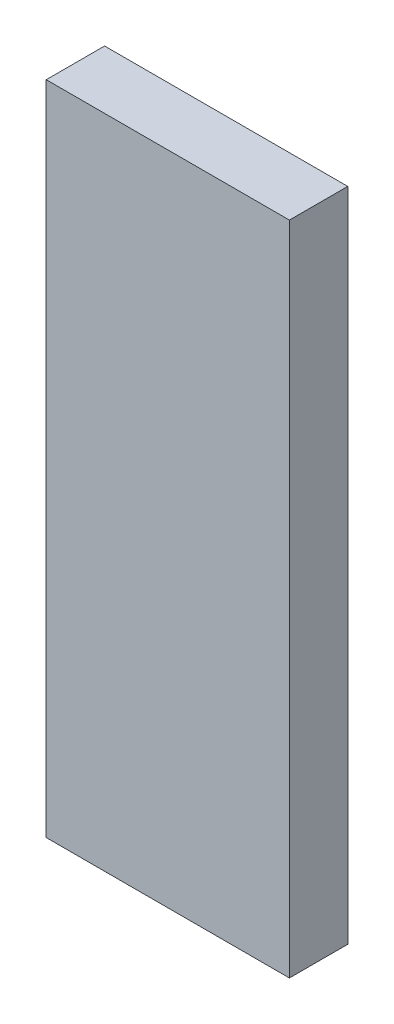
ISO-10303-21;
HEADER;
FILE_DESCRIPTION(('STEP AP214'),'2;1');
FILE_NAME('part.step','',(''),(''),'','','');
FILE_SCHEMA(('AUTOMOTIVE_DESIGN { 1 0 10303 214 1 1 1 1 }'));
ENDSEC;
DATA;
#1=APPLICATION_CONTEXT('core data for automotive mechanical design processes');
#2=APPLICATION_PROTOCOL_DEFINITION('international standard','automotive_design',2000,#1);
#3=PRODUCT_CONTEXT('',#1,'mechanical');
#4=PRODUCT('Part','Part','',(#3));
#5=PRODUCT_RELATED_PRODUCT_CATEGORY('part','',(#4));
#6=PRODUCT_DEFINITION_FORMATION('','',#4);
#7=PRODUCT_DEFINITION_CONTEXT('part definition',#1,'design');
#8=PRODUCT_DEFINITION('design','',#6,#7);
#9=PRODUCT_DEFINITION_SHAPE('','',#8);
#10=(LENGTH_UNIT() NAMED_UNIT(*) SI_UNIT(.MILLI.,.METRE.));
#11=(NAMED_UNIT(*) PLANE_ANGLE_UNIT() SI_UNIT($,.RADIAN.));
#12=(NAMED_UNIT(*) SI_UNIT($,.STERADIAN.) SOLID_ANGLE_UNIT());
#13=UNCERTAINTY_MEASURE_WITH_UNIT(LENGTH_MEASURE(1.E-05),#10,'distance_accuracy_value','');
#14=(GEOMETRIC_REPRESENTATION_CONTEXT(3) GLOBAL_UNCERTAINTY_ASSIGNED_CONTEXT((#13)) GLOBAL_UNIT_ASSIGNED_CONTEXT((#10,
#11,#12)) REPRESENTATION_CONTEXT('',''));
#15=CARTESIAN_POINT('',(0.,0.,0.));
#16=DIRECTION('',(0.,0.,1.));
#17=DIRECTION('',(1.,0.,0.));
#18=AXIS2_PLACEMENT_3D('',#15,#16,#17);
#19=CARTESIAN_POINT('',(0.62500002,1.68721024,0.30000194));
#20=DIRECTION('',(0.,0.,1.));
#21=DIRECTION('',(1.,0.,0.));
#22=AXIS2_PLACEMENT_3D('',#19,#20,#21);
#23=PLANE('',#22);
#24=DIRECTION('',(1.,0.,0.));
#25=VECTOR('',#24,1.);
#26=CARTESIAN_POINT('',(-0.62500002,1.68721024,0.30000194));
#27=LINE('',#26,#25);
#28=CARTESIAN_POINT('',(-0.62500002,1.68721024,0.30000194));
#29=VERTEX_POINT('',#28);
#30=CARTESIAN_POINT('',(0.62500002,1.68721024,0.30000194));
#31=VERTEX_POINT('',#30);
#32=EDGE_CURVE('E26',#29,#31,#27,.T.);
#33=ORIENTED_EDGE('',*,*,#32,.F.);
#34=DIRECTION('',(0.,1.,0.));
#35=VECTOR('',#34,1.);
#36=CARTESIAN_POINT('',(-0.62500002,-1.68721024,0.30000194));
#37=LINE('',#36,#35);
#38=CARTESIAN_POINT('',(-0.62500002,-1.68721024,0.30000194));
#39=VERTEX_POINT('',#38);
#40=EDGE_CURVE('E83',#39,#29,#37,.T.);
#41=ORIENTED_EDGE('',*,*,#40,.F.);
#42=DIRECTION('',(-1.,0.,0.));
#43=VECTOR('',#42,1.);
#44=CARTESIAN_POINT('',(0.62500002,-1.68721024,0.30000194));
#45=LINE('',#44,#43);
#46=CARTESIAN_POINT('',(0.62500002,-1.68721024,0.30000194));
#47=VERTEX_POINT('',#46);
#48=EDGE_CURVE('E86',#47,#39,#45,.T.);
#49=ORIENTED_EDGE('',*,*,#48,.F.);
#50=DIRECTION('',(0.,-1.,0.));
#51=VECTOR('',#50,1.);
#52=CARTESIAN_POINT('',(0.62500002,1.68721024,0.30000194));
#53=LINE('',#52,#51);
#54=EDGE_CURVE('E107',#31,#47,#53,.T.);
#55=ORIENTED_EDGE('',*,*,#54,.F.);
#56=EDGE_LOOP('',(#33,#41,#49,#55));
#57=FACE_BOUND('',#56,.T.);
#58=ADVANCED_FACE('F16',(#57),#23,.T.);
#59=CARTESIAN_POINT('',(0.62500002,1.68721024,0.));
#60=DIRECTION('',(0.,0.,1.));
#61=DIRECTION('',(1.,0.,0.));
#62=AXIS2_PLACEMENT_3D('',#59,#60,#61);
#63=PLANE('',#62);
#64=DIRECTION('',(0.,-1.,0.));
#65=VECTOR('',#64,1.);
#66=CARTESIAN_POINT('',(0.62500002,1.68721024,0.));
#67=LINE('',#66,#65);
#68=CARTESIAN_POINT('',(0.62500002,1.68721024,0.));
#69=VERTEX_POINT('',#68);
#70=CARTESIAN_POINT('',(0.62500002,-1.68721024,0.));
#71=VERTEX_POINT('',#70);
#72=EDGE_CURVE('E78',#69,#71,#67,.T.);
#73=ORIENTED_EDGE('',*,*,#72,.T.);
#74=DIRECTION('',(-1.,0.,0.));
#75=VECTOR('',#74,1.);
#76=CARTESIAN_POINT('',(0.62500002,-1.68721024,0.));
#77=LINE('',#76,#75);
#78=CARTESIAN_POINT('',(-0.62500002,-1.68721024,0.));
#79=VERTEX_POINT('',#78);
#80=EDGE_CURVE('E19',#71,#79,#77,.T.);
#81=ORIENTED_EDGE('',*,*,#80,.T.);
#82=DIRECTION('',(0.,1.,0.));
#83=VECTOR('',#82,1.);
#84=CARTESIAN_POINT('',(-0.62500002,-1.68721024,0.));
#85=LINE('',#84,#83);
#86=CARTESIAN_POINT('',(-0.62500002,1.68721024,0.));
#87=VERTEX_POINT('',#86);
#88=EDGE_CURVE('E64',#79,#87,#85,.T.);
#89=ORIENTED_EDGE('',*,*,#88,.T.);
#90=DIRECTION('',(1.,0.,0.));
#91=VECTOR('',#90,1.);
#92=CARTESIAN_POINT('',(-0.62500002,1.68721024,0.));
#93=LINE('',#92,#91);
#94=EDGE_CURVE('E10',#87,#69,#93,.T.);
#95=ORIENTED_EDGE('',*,*,#94,.T.);
#96=EDGE_LOOP('',(#73,#81,#89,#95));
#97=FACE_BOUND('',#96,.T.);
#98=ADVANCED_FACE('F76',(#97),#63,.F.);
#99=CARTESIAN_POINT('',(-0.62500002,1.68721024,0.));
#100=DIRECTION('',(0.,1.,0.));
#101=DIRECTION('',(1.,0.,0.));
#102=AXIS2_PLACEMENT_3D('',#99,#100,#101);
#103=PLANE('',#102);
#104=DIRECTION('',(0.,0.,1.));
#105=VECTOR('',#104,1.);
#106=CARTESIAN_POINT('',(-0.62500002,1.68721024,0.));
#107=LINE('',#106,#105);
#108=EDGE_CURVE('E71',#87,#29,#107,.T.);
#109=ORIENTED_EDGE('',*,*,#108,.T.);
#110=ORIENTED_EDGE('',*,*,#32,.T.);
#111=DIRECTION('',(0.,0.,1.));
#112=VECTOR('',#111,1.);
#113=CARTESIAN_POINT('',(0.62500002,1.68721024,0.));
#114=LINE('',#113,#112);
#115=EDGE_CURVE('E104',#69,#31,#114,.T.);
#116=ORIENTED_EDGE('',*,*,#115,.F.);
#117=ORIENTED_EDGE('',*,*,#94,.F.);
#118=EDGE_LOOP('',(#109,#110,#116,#117));
#119=FACE_BOUND('',#118,.T.);
#120=ADVANCED_FACE('F111',(#119),#103,.T.);
#121=CARTESIAN_POINT('',(-0.62500002,-1.68721024,0.));
#122=DIRECTION('',(-1.,0.,0.));
#123=DIRECTION('',(0.,0.,1.));
#124=AXIS2_PLACEMENT_3D('',#121,#122,#123);
#125=PLANE('',#124);
#126=DIRECTION('',(0.,0.,1.));
#127=VECTOR('',#126,1.);
#128=CARTESIAN_POINT('',(-0.62500002,-1.68721024,0.));
#129=LINE('',#128,#127);
#130=EDGE_CURVE('E69',#79,#39,#129,.T.);
#131=ORIENTED_EDGE('',*,*,#130,.T.);
#132=ORIENTED_EDGE('',*,*,#40,.T.);
#133=ORIENTED_EDGE('',*,*,#108,.F.);
#134=ORIENTED_EDGE('',*,*,#88,.F.);
#135=EDGE_LOOP('',(#131,#132,#133,#134));
#136=FACE_BOUND('',#135,.T.);
#137=ADVANCED_FACE('F66',(#136),#125,.T.);
#138=CARTESIAN_POINT('',(0.62500002,-1.68721024,0.));
#139=DIRECTION('',(0.,-1.,0.));
#140=DIRECTION('',(0.,0.,-1.));
#141=AXIS2_PLACEMENT_3D('',#138,#139,#140);
#142=PLANE('',#141);
#143=DIRECTION('',(0.,0.,1.));
#144=VECTOR('',#143,1.);
#145=CARTESIAN_POINT('',(0.62500002,-1.68721024,0.));
#146=LINE('',#145,#144);
#147=EDGE_CURVE('E96',#71,#47,#146,.T.);
#148=ORIENTED_EDGE('',*,*,#147,.T.);
#149=ORIENTED_EDGE('',*,*,#48,.T.);
#150=ORIENTED_EDGE('',*,*,#130,.F.);
#151=ORIENTED_EDGE('',*,*,#80,.F.);
#152=EDGE_LOOP('',(#148,#149,#150,#151));
#153=FACE_BOUND('',#152,.T.);
#154=ADVANCED_FACE('F84',(#153),#142,.T.);
#155=CARTESIAN_POINT('',(0.62500002,1.68721024,0.));
#156=DIRECTION('',(1.,0.,0.));
#157=DIRECTION('',(0.,1.,0.));
#158=AXIS2_PLACEMENT_3D('',#155,#156,#157);
#159=PLANE('',#158);
#160=ORIENTED_EDGE('',*,*,#115,.T.);
#161=ORIENTED_EDGE('',*,*,#54,.T.);
#162=ORIENTED_EDGE('',*,*,#147,.F.);
#163=ORIENTED_EDGE('',*,*,#72,.F.);
#164=EDGE_LOOP('',(#160,#161,#162,#163));
#165=FACE_BOUND('',#164,.T.);
#166=ADVANCED_FACE('F117',(#165),#159,.T.);
#167=CLOSED_SHELL('',(#58,#98,#120,#137,#154,#166));
#168=MANIFOLD_SOLID_BREP('B1',#167);
#169=ADVANCED_BREP_SHAPE_REPRESENTATION('',(#18,#168),#14);
#170=SHAPE_DEFINITION_REPRESENTATION(#9,#169);
ENDSEC;
END-ISO-10303-21;
